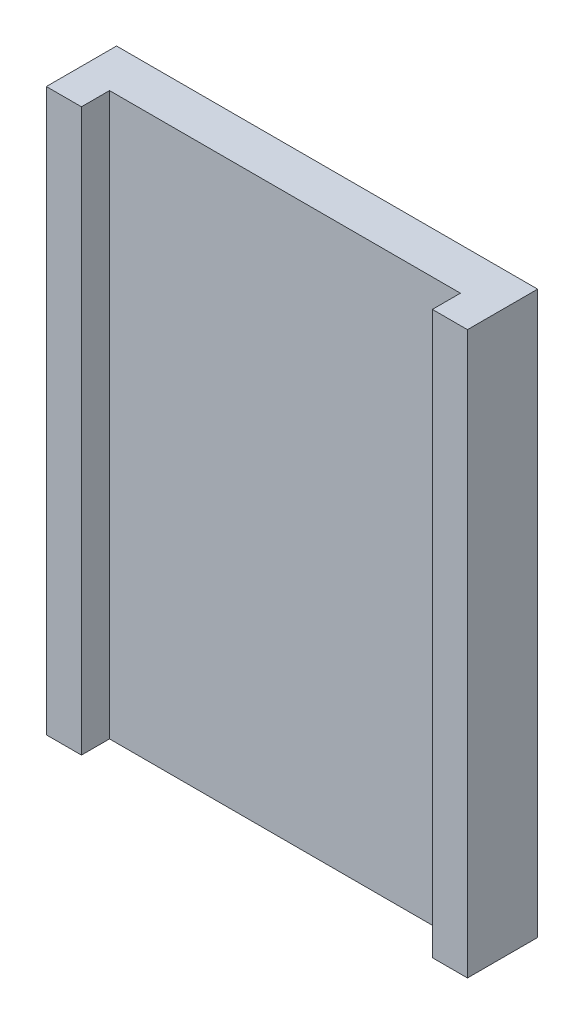
ISO-10303-21;
HEADER;
FILE_DESCRIPTION(('STEP AP214'),'2;1');
FILE_NAME('part.step','',(''),(''),'','','');
FILE_SCHEMA(('AUTOMOTIVE_DESIGN { 1 0 10303 214 1 1 1 1 }'));
ENDSEC;
DATA;
#1=APPLICATION_CONTEXT('core data for automotive mechanical design processes');
#2=APPLICATION_PROTOCOL_DEFINITION('international standard','automotive_design',2000,#1);
#3=PRODUCT_CONTEXT('',#1,'mechanical');
#4=PRODUCT('Part','Part','',(#3));
#5=PRODUCT_RELATED_PRODUCT_CATEGORY('part','',(#4));
#6=PRODUCT_DEFINITION_FORMATION('','',#4);
#7=PRODUCT_DEFINITION_CONTEXT('part definition',#1,'design');
#8=PRODUCT_DEFINITION('design','',#6,#7);
#9=PRODUCT_DEFINITION_SHAPE('','',#8);
#10=(LENGTH_UNIT() NAMED_UNIT(*) SI_UNIT(.MILLI.,.METRE.));
#11=(NAMED_UNIT(*) PLANE_ANGLE_UNIT() SI_UNIT($,.RADIAN.));
#12=(NAMED_UNIT(*) SI_UNIT($,.STERADIAN.) SOLID_ANGLE_UNIT());
#13=UNCERTAINTY_MEASURE_WITH_UNIT(LENGTH_MEASURE(1.E-05),#10,'distance_accuracy_value','');
#14=(GEOMETRIC_REPRESENTATION_CONTEXT(3) GLOBAL_UNCERTAINTY_ASSIGNED_CONTEXT((#13)) GLOBAL_UNIT_ASSIGNED_CONTEXT((#10,
#11,#12)) REPRESENTATION_CONTEXT('',''));
#15=CARTESIAN_POINT('',(0.,0.,0.));
#16=DIRECTION('',(0.,0.,1.));
#17=DIRECTION('',(1.,0.,0.));
#18=AXIS2_PLACEMENT_3D('',#15,#16,#17);
#19=CARTESIAN_POINT('',(0.,5.,0.75));
#20=DIRECTION('',(0.,1.,0.));
#21=DIRECTION('',(0.,0.,1.));
#22=AXIS2_PLACEMENT_3D('',#19,#20,#21);
#23=PLANE('',#22);
#24=DIRECTION('',(1.,0.,0.));
#25=VECTOR('',#24,1.);
#26=CARTESIAN_POINT('',(0.,5.,0.));
#27=LINE('',#26,#25);
#28=CARTESIAN_POINT('',(-3.75,5.,0.));
#29=VERTEX_POINT('',#28);
#30=CARTESIAN_POINT('',(3.75,5.,0.));
#31=VERTEX_POINT('',#30);
#32=EDGE_CURVE('E178',#29,#31,#27,.T.);
#33=ORIENTED_EDGE('',*,*,#32,.F.);
#34=DIRECTION('',(0.,0.,-1.));
#35=VECTOR('',#34,1.);
#36=CARTESIAN_POINT('',(-3.75,5.,1.25));
#37=LINE('',#36,#35);
#38=CARTESIAN_POINT('',(-3.75,5.,1.25));
#39=VERTEX_POINT('',#38);
#40=EDGE_CURVE('E113',#39,#29,#37,.T.);
#41=ORIENTED_EDGE('',*,*,#40,.F.);
#42=DIRECTION('',(1.,0.,0.));
#43=VECTOR('',#42,1.);
#44=CARTESIAN_POINT('',(0.,5.,1.25));
#45=LINE('',#44,#43);
#46=CARTESIAN_POINT('',(-3.125,5.,1.25));
#47=VERTEX_POINT('',#46);
#48=EDGE_CURVE('E118',#39,#47,#45,.T.);
#49=ORIENTED_EDGE('',*,*,#48,.T.);
#50=DIRECTION('',(0.,0.,-1.));
#51=VECTOR('',#50,1.);
#52=CARTESIAN_POINT('',(-3.125,5.,1.25));
#53=LINE('',#52,#51);
#54=CARTESIAN_POINT('',(-3.125,5.,0.75));
#55=VERTEX_POINT('',#54);
#56=EDGE_CURVE('E105',#47,#55,#53,.T.);
#57=ORIENTED_EDGE('',*,*,#56,.T.);
#58=DIRECTION('',(1.,0.,0.));
#59=VECTOR('',#58,1.);
#60=CARTESIAN_POINT('',(0.,5.,0.75));
#61=LINE('',#60,#59);
#62=CARTESIAN_POINT('',(3.125,5.,0.75));
#63=VERTEX_POINT('',#62);
#64=EDGE_CURVE('E181',#55,#63,#61,.T.);
#65=ORIENTED_EDGE('',*,*,#64,.T.);
#66=DIRECTION('',(0.,0.,-1.));
#67=VECTOR('',#66,1.);
#68=CARTESIAN_POINT('',(3.125,5.,1.25));
#69=LINE('',#68,#67);
#70=CARTESIAN_POINT('',(3.125,5.,1.25));
#71=VERTEX_POINT('',#70);
#72=EDGE_CURVE('E174',#71,#63,#69,.T.);
#73=ORIENTED_EDGE('',*,*,#72,.F.);
#74=DIRECTION('',(1.,0.,0.));
#75=VECTOR('',#74,1.);
#76=CARTESIAN_POINT('',(0.,5.,1.25));
#77=LINE('',#76,#75);
#78=CARTESIAN_POINT('',(3.75,5.,1.25));
#79=VERTEX_POINT('',#78);
#80=EDGE_CURVE('E145',#71,#79,#77,.T.);
#81=ORIENTED_EDGE('',*,*,#80,.T.);
#82=DIRECTION('',(0.,0.,-1.));
#83=VECTOR('',#82,1.);
#84=CARTESIAN_POINT('',(3.75,5.,1.25));
#85=LINE('',#84,#83);
#86=EDGE_CURVE('E159',#79,#31,#85,.T.);
#87=ORIENTED_EDGE('',*,*,#86,.T.);
#88=EDGE_LOOP('',(#33,#41,#49,#57,#65,#73,#81,#87));
#89=FACE_BOUND('',#88,.T.);
#90=ADVANCED_FACE('F39',(#89),#23,.T.);
#91=CARTESIAN_POINT('',(0.,-5.,0.75));
#92=DIRECTION('',(0.,1.,0.));
#93=DIRECTION('',(0.,0.,1.));
#94=AXIS2_PLACEMENT_3D('',#91,#92,#93);
#95=PLANE('',#94);
#96=DIRECTION('',(1.,0.,0.));
#97=VECTOR('',#96,1.);
#98=CARTESIAN_POINT('',(0.,-5.,0.));
#99=LINE('',#98,#97);
#100=CARTESIAN_POINT('',(-3.75,-5.,0.));
#101=VERTEX_POINT('',#100);
#102=CARTESIAN_POINT('',(3.75,-5.,0.));
#103=VERTEX_POINT('',#102);
#104=EDGE_CURVE('E42',#101,#103,#99,.T.);
#105=ORIENTED_EDGE('',*,*,#104,.T.);
#106=DIRECTION('',(0.,0.,-1.));
#107=VECTOR('',#106,1.);
#108=CARTESIAN_POINT('',(3.75,-5.,1.25));
#109=LINE('',#108,#107);
#110=CARTESIAN_POINT('',(3.75,-5.,1.25));
#111=VERTEX_POINT('',#110);
#112=EDGE_CURVE('E166',#111,#103,#109,.T.);
#113=ORIENTED_EDGE('',*,*,#112,.F.);
#114=DIRECTION('',(1.,0.,0.));
#115=VECTOR('',#114,1.);
#116=CARTESIAN_POINT('',(0.,-5.,1.25));
#117=LINE('',#116,#115);
#118=CARTESIAN_POINT('',(3.125,-5.,1.25));
#119=VERTEX_POINT('',#118);
#120=EDGE_CURVE('E152',#119,#111,#117,.T.);
#121=ORIENTED_EDGE('',*,*,#120,.F.);
#122=DIRECTION('',(0.,0.,-1.));
#123=VECTOR('',#122,1.);
#124=CARTESIAN_POINT('',(3.125,-5.,1.25));
#125=LINE('',#124,#123);
#126=CARTESIAN_POINT('',(3.125,-5.,0.75));
#127=VERTEX_POINT('',#126);
#128=EDGE_CURVE('E170',#119,#127,#125,.T.);
#129=ORIENTED_EDGE('',*,*,#128,.T.);
#130=DIRECTION('',(1.,0.,0.));
#131=VECTOR('',#130,1.);
#132=CARTESIAN_POINT('',(0.,-5.,0.75));
#133=LINE('',#132,#131);
#134=CARTESIAN_POINT('',(-3.125,-5.,0.75));
#135=VERTEX_POINT('',#134);
#136=EDGE_CURVE('E11',#135,#127,#133,.T.);
#137=ORIENTED_EDGE('',*,*,#136,.F.);
#138=DIRECTION('',(0.,0.,-1.));
#139=VECTOR('',#138,1.);
#140=CARTESIAN_POINT('',(-3.125,-5.,1.25));
#141=LINE('',#140,#139);
#142=CARTESIAN_POINT('',(-3.125,-5.,1.25));
#143=VERTEX_POINT('',#142);
#144=EDGE_CURVE('E56',#143,#135,#141,.T.);
#145=ORIENTED_EDGE('',*,*,#144,.F.);
#146=DIRECTION('',(1.,0.,0.));
#147=VECTOR('',#146,1.);
#148=CARTESIAN_POINT('',(0.,-5.,1.25));
#149=LINE('',#148,#147);
#150=CARTESIAN_POINT('',(-3.75,-5.,1.25));
#151=VERTEX_POINT('',#150);
#152=EDGE_CURVE('E120',#151,#143,#149,.T.);
#153=ORIENTED_EDGE('',*,*,#152,.F.);
#154=DIRECTION('',(0.,0.,-1.));
#155=VECTOR('',#154,1.);
#156=CARTESIAN_POINT('',(-3.75,-5.,1.25));
#157=LINE('',#156,#155);
#158=EDGE_CURVE('E139',#151,#101,#157,.T.);
#159=ORIENTED_EDGE('',*,*,#158,.T.);
#160=EDGE_LOOP('',(#105,#113,#121,#129,#137,#145,#153,#159));
#161=FACE_BOUND('',#160,.T.);
#162=ADVANCED_FACE('F191',(#161),#95,.F.);
#163=CARTESIAN_POINT('',(0.,0.,0.75));
#164=DIRECTION('',(0.,0.,1.));
#165=DIRECTION('',(1.,0.,0.));
#166=AXIS2_PLACEMENT_3D('',#163,#164,#165);
#167=PLANE('',#166);
#168=DIRECTION('',(0.,-1.,0.));
#169=VECTOR('',#168,1.);
#170=CARTESIAN_POINT('',(3.125,0.,0.75));
#171=LINE('',#170,#169);
#172=EDGE_CURVE('E63',#63,#127,#171,.T.);
#173=ORIENTED_EDGE('',*,*,#172,.F.);
#174=ORIENTED_EDGE('',*,*,#64,.F.);
#175=DIRECTION('',(0.,-1.,0.));
#176=VECTOR('',#175,1.);
#177=CARTESIAN_POINT('',(-3.125,0.,0.75));
#178=LINE('',#177,#176);
#179=EDGE_CURVE('E48',#55,#135,#178,.T.);
#180=ORIENTED_EDGE('',*,*,#179,.T.);
#181=ORIENTED_EDGE('',*,*,#136,.T.);
#182=EDGE_LOOP('',(#173,#174,#180,#181));
#183=FACE_BOUND('',#182,.T.);
#184=ADVANCED_FACE('F201',(#183),#167,.T.);
#185=CARTESIAN_POINT('',(0.,0.,0.));
#186=DIRECTION('',(0.,0.,1.));
#187=DIRECTION('',(1.,0.,0.));
#188=AXIS2_PLACEMENT_3D('',#185,#186,#187);
#189=PLANE('',#188);
#190=ORIENTED_EDGE('',*,*,#32,.T.);
#191=DIRECTION('',(0.,-1.,0.));
#192=VECTOR('',#191,1.);
#193=CARTESIAN_POINT('',(3.75,0.,0.));
#194=LINE('',#193,#192);
#195=EDGE_CURVE('E112',#31,#103,#194,.T.);
#196=ORIENTED_EDGE('',*,*,#195,.T.);
#197=ORIENTED_EDGE('',*,*,#104,.F.);
#198=DIRECTION('',(0.,-1.,0.));
#199=VECTOR('',#198,1.);
#200=CARTESIAN_POINT('',(-3.75,0.,0.));
#201=LINE('',#200,#199);
#202=EDGE_CURVE('E122',#29,#101,#201,.T.);
#203=ORIENTED_EDGE('',*,*,#202,.F.);
#204=EDGE_LOOP('',(#190,#196,#197,#203));
#205=FACE_BOUND('',#204,.T.);
#206=ADVANCED_FACE('F198',(#205),#189,.F.);
#207=CARTESIAN_POINT('',(3.125,0.,1.25));
#208=DIRECTION('',(1.,0.,0.));
#209=DIRECTION('',(0.,1.,0.));
#210=AXIS2_PLACEMENT_3D('',#207,#208,#209);
#211=PLANE('',#210);
#212=ORIENTED_EDGE('',*,*,#72,.T.);
#213=ORIENTED_EDGE('',*,*,#172,.T.);
#214=ORIENTED_EDGE('',*,*,#128,.F.);
#215=DIRECTION('',(0.,-1.,0.));
#216=VECTOR('',#215,1.);
#217=CARTESIAN_POINT('',(3.125,0.,1.25));
#218=LINE('',#217,#216);
#219=EDGE_CURVE('E149',#71,#119,#218,.T.);
#220=ORIENTED_EDGE('',*,*,#219,.F.);
#221=EDGE_LOOP('',(#212,#213,#214,#220));
#222=FACE_BOUND('',#221,.T.);
#223=ADVANCED_FACE('F200',(#222),#211,.F.);
#224=CARTESIAN_POINT('',(3.75,0.,1.25));
#225=DIRECTION('',(1.,0.,0.));
#226=DIRECTION('',(0.,1.,0.));
#227=AXIS2_PLACEMENT_3D('',#224,#225,#226);
#228=PLANE('',#227);
#229=ORIENTED_EDGE('',*,*,#195,.F.);
#230=ORIENTED_EDGE('',*,*,#86,.F.);
#231=DIRECTION('',(0.,-1.,0.));
#232=VECTOR('',#231,1.);
#233=CARTESIAN_POINT('',(3.75,0.,1.25));
#234=LINE('',#233,#232);
#235=EDGE_CURVE('E155',#79,#111,#234,.T.);
#236=ORIENTED_EDGE('',*,*,#235,.T.);
#237=ORIENTED_EDGE('',*,*,#112,.T.);
#238=EDGE_LOOP('',(#229,#230,#236,#237));
#239=FACE_BOUND('',#238,.T.);
#240=ADVANCED_FACE('F196',(#239),#228,.T.);
#241=CARTESIAN_POINT('',(0.,0.,1.25));
#242=DIRECTION('',(0.,0.,1.));
#243=DIRECTION('',(1.,0.,0.));
#244=AXIS2_PLACEMENT_3D('',#241,#242,#243);
#245=PLANE('',#244);
#246=ORIENTED_EDGE('',*,*,#80,.F.);
#247=ORIENTED_EDGE('',*,*,#219,.T.);
#248=ORIENTED_EDGE('',*,*,#120,.T.);
#249=ORIENTED_EDGE('',*,*,#235,.F.);
#250=EDGE_LOOP('',(#246,#247,#248,#249));
#251=FACE_BOUND('',#250,.T.);
#252=ADVANCED_FACE('F242',(#251),#245,.T.);
#253=CARTESIAN_POINT('',(-3.125,0.,1.25));
#254=DIRECTION('',(1.,0.,0.));
#255=DIRECTION('',(0.,1.,0.));
#256=AXIS2_PLACEMENT_3D('',#253,#254,#255);
#257=PLANE('',#256);
#258=ORIENTED_EDGE('',*,*,#179,.F.);
#259=ORIENTED_EDGE('',*,*,#56,.F.);
#260=DIRECTION('',(0.,-1.,0.));
#261=VECTOR('',#260,1.);
#262=CARTESIAN_POINT('',(-3.125,0.,1.25));
#263=LINE('',#262,#261);
#264=EDGE_CURVE('E108',#47,#143,#263,.T.);
#265=ORIENTED_EDGE('',*,*,#264,.T.);
#266=ORIENTED_EDGE('',*,*,#144,.T.);
#267=EDGE_LOOP('',(#258,#259,#265,#266));
#268=FACE_BOUND('',#267,.T.);
#269=ADVANCED_FACE('F107',(#268),#257,.T.);
#270=CARTESIAN_POINT('',(-3.75,0.,1.25));
#271=DIRECTION('',(1.,0.,0.));
#272=DIRECTION('',(0.,1.,0.));
#273=AXIS2_PLACEMENT_3D('',#270,#271,#272);
#274=PLANE('',#273);
#275=ORIENTED_EDGE('',*,*,#202,.T.);
#276=ORIENTED_EDGE('',*,*,#158,.F.);
#277=DIRECTION('',(0.,-1.,0.));
#278=VECTOR('',#277,1.);
#279=CARTESIAN_POINT('',(-3.75,0.,1.25));
#280=LINE('',#279,#278);
#281=EDGE_CURVE('E127',#39,#151,#280,.T.);
#282=ORIENTED_EDGE('',*,*,#281,.F.);
#283=ORIENTED_EDGE('',*,*,#40,.T.);
#284=EDGE_LOOP('',(#275,#276,#282,#283));
#285=FACE_BOUND('',#284,.T.);
#286=ADVANCED_FACE('F260',(#285),#274,.F.);
#287=CARTESIAN_POINT('',(0.,0.,1.25));
#288=DIRECTION('',(0.,0.,1.));
#289=DIRECTION('',(1.,0.,0.));
#290=AXIS2_PLACEMENT_3D('',#287,#288,#289);
#291=PLANE('',#290);
#292=ORIENTED_EDGE('',*,*,#264,.F.);
#293=ORIENTED_EDGE('',*,*,#48,.F.);
#294=ORIENTED_EDGE('',*,*,#281,.T.);
#295=ORIENTED_EDGE('',*,*,#152,.T.);
#296=EDGE_LOOP('',(#292,#293,#294,#295));
#297=FACE_BOUND('',#296,.T.);
#298=ADVANCED_FACE('F117',(#297),#291,.T.);
#299=CLOSED_SHELL('',(#90,#162,#184,#206,#223,#240,#252,#269,#286,#298));
#300=MANIFOLD_SOLID_BREP('B2',#299);
#301=ADVANCED_BREP_SHAPE_REPRESENTATION('',(#18,#300),#14);
#302=SHAPE_DEFINITION_REPRESENTATION(#9,#301);
ENDSEC;
END-ISO-10303-21;
